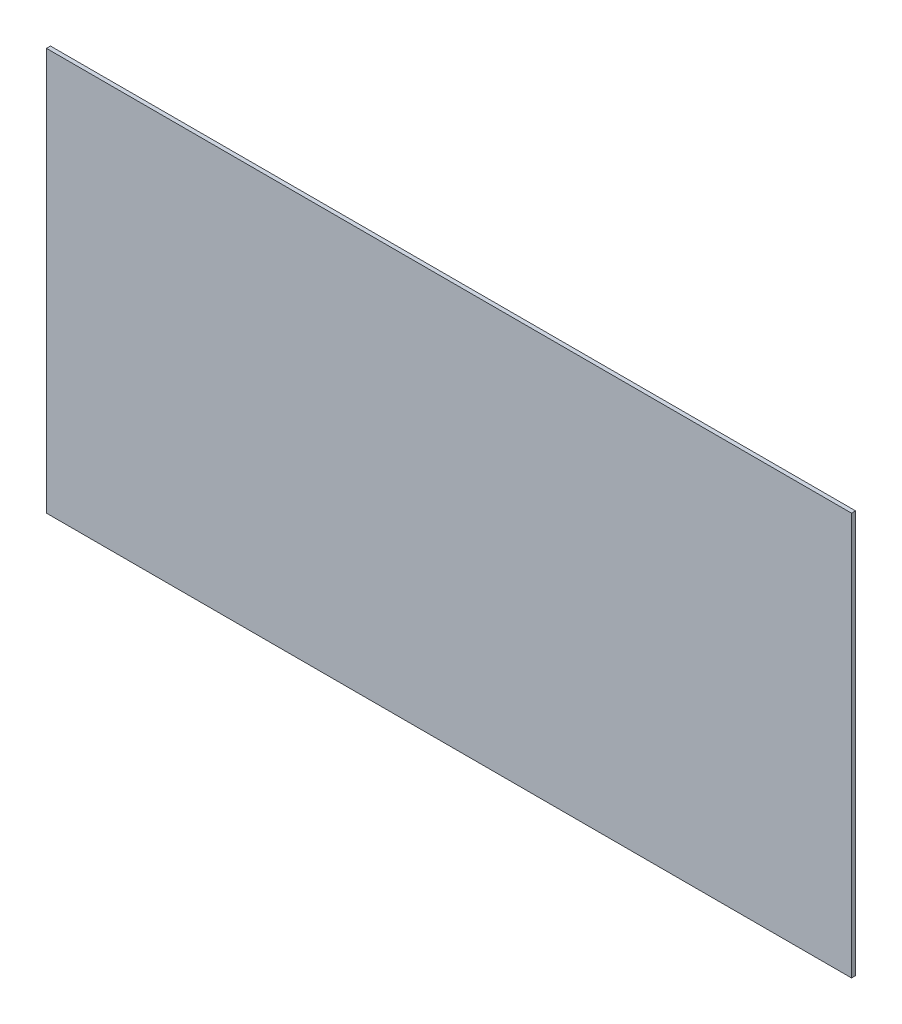
ISO-10303-21;
HEADER;
FILE_DESCRIPTION(('STEP AP214'),'2;1');
FILE_NAME('part.step','',(''),(''),'','','');
FILE_SCHEMA(('AUTOMOTIVE_DESIGN { 1 0 10303 214 1 1 1 1 }'));
ENDSEC;
DATA;
#1=APPLICATION_CONTEXT('core data for automotive mechanical design processes');
#2=APPLICATION_PROTOCOL_DEFINITION('international standard','automotive_design',2000,#1);
#3=PRODUCT_CONTEXT('',#1,'mechanical');
#4=PRODUCT('Part','Part','',(#3));
#5=PRODUCT_RELATED_PRODUCT_CATEGORY('part','',(#4));
#6=PRODUCT_DEFINITION_FORMATION('','',#4);
#7=PRODUCT_DEFINITION_CONTEXT('part definition',#1,'design');
#8=PRODUCT_DEFINITION('design','',#6,#7);
#9=PRODUCT_DEFINITION_SHAPE('','',#8);
#10=(LENGTH_UNIT() NAMED_UNIT(*) SI_UNIT(.MILLI.,.METRE.));
#11=(NAMED_UNIT(*) PLANE_ANGLE_UNIT() SI_UNIT($,.RADIAN.));
#12=(NAMED_UNIT(*) SI_UNIT($,.STERADIAN.) SOLID_ANGLE_UNIT());
#13=UNCERTAINTY_MEASURE_WITH_UNIT(LENGTH_MEASURE(1.E-05),#10,'distance_accuracy_value','');
#14=(GEOMETRIC_REPRESENTATION_CONTEXT(3) GLOBAL_UNCERTAINTY_ASSIGNED_CONTEXT((#13)) GLOBAL_UNIT_ASSIGNED_CONTEXT((#10,
#11,#12)) REPRESENTATION_CONTEXT('',''));
#15=CARTESIAN_POINT('',(0.,0.,0.));
#16=DIRECTION('',(0.,0.,1.));
#17=DIRECTION('',(1.,0.,0.));
#18=AXIS2_PLACEMENT_3D('',#15,#16,#17);
#19=CARTESIAN_POINT('',(0.,0.,3.));
#20=DIRECTION('',(1.,0.,0.));
#21=DIRECTION('',(0.,0.,-1.));
#22=AXIS2_PLACEMENT_3D('',#19,#20,#21);
#23=PLANE('',#22);
#24=DIRECTION('',(0.,-1.,0.));
#25=VECTOR('',#24,1.);
#26=CARTESIAN_POINT('',(0.,0.,0.));
#27=LINE('',#26,#25);
#28=CARTESIAN_POINT('',(0.,300.,0.));
#29=VERTEX_POINT('',#28);
#30=CARTESIAN_POINT('',(0.,0.,0.));
#31=VERTEX_POINT('',#30);
#32=EDGE_CURVE('E95',#29,#31,#27,.T.);
#33=ORIENTED_EDGE('',*,*,#32,.T.);
#34=DIRECTION('',(0.,0.,-1.));
#35=VECTOR('',#34,1.);
#36=CARTESIAN_POINT('',(0.,0.,3.));
#37=LINE('',#36,#35);
#38=CARTESIAN_POINT('',(0.,0.,3.));
#39=VERTEX_POINT('',#38);
#40=EDGE_CURVE('E11',#39,#31,#37,.T.);
#41=ORIENTED_EDGE('',*,*,#40,.F.);
#42=DIRECTION('',(0.,-1.,0.));
#43=VECTOR('',#42,1.);
#44=CARTESIAN_POINT('',(0.,0.,3.));
#45=LINE('',#44,#43);
#46=CARTESIAN_POINT('',(0.,300.,3.));
#47=VERTEX_POINT('',#46);
#48=EDGE_CURVE('E83',#47,#39,#45,.T.);
#49=ORIENTED_EDGE('',*,*,#48,.F.);
#50=DIRECTION('',(0.,0.,-1.));
#51=VECTOR('',#50,1.);
#52=CARTESIAN_POINT('',(0.,300.,3.));
#53=LINE('',#52,#51);
#54=EDGE_CURVE('E91',#47,#29,#53,.T.);
#55=ORIENTED_EDGE('',*,*,#54,.T.);
#56=EDGE_LOOP('',(#33,#41,#49,#55));
#57=FACE_BOUND('',#56,.T.);
#58=ADVANCED_FACE('F32',(#57),#23,.F.);
#59=CARTESIAN_POINT('',(0.,0.,3.));
#60=DIRECTION('',(0.,1.,0.));
#61=DIRECTION('',(0.,0.,1.));
#62=AXIS2_PLACEMENT_3D('',#59,#60,#61);
#63=PLANE('',#62);
#64=DIRECTION('',(1.,0.,0.));
#65=VECTOR('',#64,1.);
#66=CARTESIAN_POINT('',(0.,0.,0.));
#67=LINE('',#66,#65);
#68=CARTESIAN_POINT('',(600.,0.,0.));
#69=VERTEX_POINT('',#68);
#70=EDGE_CURVE('E87',#31,#69,#67,.T.);
#71=ORIENTED_EDGE('',*,*,#70,.T.);
#72=DIRECTION('',(0.,0.,-1.));
#73=VECTOR('',#72,1.);
#74=CARTESIAN_POINT('',(600.,0.,3.));
#75=LINE('',#74,#73);
#76=CARTESIAN_POINT('',(600.,0.,3.));
#77=VERTEX_POINT('',#76);
#78=EDGE_CURVE('E40',#77,#69,#75,.T.);
#79=ORIENTED_EDGE('',*,*,#78,.F.);
#80=DIRECTION('',(1.,0.,0.));
#81=VECTOR('',#80,1.);
#82=CARTESIAN_POINT('',(0.,0.,3.));
#83=LINE('',#82,#81);
#84=EDGE_CURVE('E78',#39,#77,#83,.T.);
#85=ORIENTED_EDGE('',*,*,#84,.F.);
#86=ORIENTED_EDGE('',*,*,#40,.T.);
#87=EDGE_LOOP('',(#71,#79,#85,#86));
#88=FACE_BOUND('',#87,.T.);
#89=ADVANCED_FACE('F86',(#88),#63,.F.);
#90=CARTESIAN_POINT('',(600.,0.,3.));
#91=DIRECTION('',(-1.,0.,0.));
#92=DIRECTION('',(0.,0.,1.));
#93=AXIS2_PLACEMENT_3D('',#90,#91,#92);
#94=PLANE('',#93);
#95=DIRECTION('',(0.,1.,0.));
#96=VECTOR('',#95,1.);
#97=CARTESIAN_POINT('',(600.,0.,0.));
#98=LINE('',#97,#96);
#99=CARTESIAN_POINT('',(600.,300.,0.));
#100=VERTEX_POINT('',#99);
#101=EDGE_CURVE('E65',#69,#100,#98,.T.);
#102=ORIENTED_EDGE('',*,*,#101,.T.);
#103=DIRECTION('',(0.,0.,-1.));
#104=VECTOR('',#103,1.);
#105=CARTESIAN_POINT('',(600.,300.,3.));
#106=LINE('',#105,#104);
#107=CARTESIAN_POINT('',(600.,300.,3.));
#108=VERTEX_POINT('',#107);
#109=EDGE_CURVE('E88',#108,#100,#106,.T.);
#110=ORIENTED_EDGE('',*,*,#109,.F.);
#111=DIRECTION('',(0.,1.,0.));
#112=VECTOR('',#111,1.);
#113=CARTESIAN_POINT('',(600.,0.,3.));
#114=LINE('',#113,#112);
#115=EDGE_CURVE('E81',#77,#108,#114,.T.);
#116=ORIENTED_EDGE('',*,*,#115,.F.);
#117=ORIENTED_EDGE('',*,*,#78,.T.);
#118=EDGE_LOOP('',(#102,#110,#116,#117));
#119=FACE_BOUND('',#118,.T.);
#120=ADVANCED_FACE('F89',(#119),#94,.F.);
#121=CARTESIAN_POINT('',(0.,300.,3.));
#122=DIRECTION('',(0.,-1.,0.));
#123=DIRECTION('',(0.,0.,-1.));
#124=AXIS2_PLACEMENT_3D('',#121,#122,#123);
#125=PLANE('',#124);
#126=DIRECTION('',(-1.,0.,0.));
#127=VECTOR('',#126,1.);
#128=CARTESIAN_POINT('',(0.,300.,0.));
#129=LINE('',#128,#127);
#130=EDGE_CURVE('E71',#100,#29,#129,.T.);
#131=ORIENTED_EDGE('',*,*,#130,.T.);
#132=ORIENTED_EDGE('',*,*,#54,.F.);
#133=DIRECTION('',(-1.,0.,0.));
#134=VECTOR('',#133,1.);
#135=CARTESIAN_POINT('',(0.,300.,3.));
#136=LINE('',#135,#134);
#137=EDGE_CURVE('E48',#108,#47,#136,.T.);
#138=ORIENTED_EDGE('',*,*,#137,.F.);
#139=ORIENTED_EDGE('',*,*,#109,.T.);
#140=EDGE_LOOP('',(#131,#132,#138,#139));
#141=FACE_BOUND('',#140,.T.);
#142=ADVANCED_FACE('F102',(#141),#125,.F.);
#143=CARTESIAN_POINT('',(0.,0.,3.));
#144=DIRECTION('',(0.,0.,-1.));
#145=DIRECTION('',(-1.,0.,0.));
#146=AXIS2_PLACEMENT_3D('',#143,#144,#145);
#147=PLANE('',#146);
#148=ORIENTED_EDGE('',*,*,#48,.T.);
#149=ORIENTED_EDGE('',*,*,#84,.T.);
#150=ORIENTED_EDGE('',*,*,#115,.T.);
#151=ORIENTED_EDGE('',*,*,#137,.T.);
#152=EDGE_LOOP('',(#148,#149,#150,#151));
#153=FACE_BOUND('',#152,.T.);
#154=ADVANCED_FACE('F79',(#153),#147,.F.);
#155=CARTESIAN_POINT('',(0.,0.,0.));
#156=DIRECTION('',(0.,0.,-1.));
#157=DIRECTION('',(-1.,0.,0.));
#158=AXIS2_PLACEMENT_3D('',#155,#156,#157);
#159=PLANE('',#158);
#160=ORIENTED_EDGE('',*,*,#32,.F.);
#161=ORIENTED_EDGE('',*,*,#130,.F.);
#162=ORIENTED_EDGE('',*,*,#101,.F.);
#163=ORIENTED_EDGE('',*,*,#70,.F.);
#164=EDGE_LOOP('',(#160,#161,#162,#163));
#165=FACE_BOUND('',#164,.T.);
#166=ADVANCED_FACE('F105',(#165),#159,.T.);
#167=CLOSED_SHELL('',(#58,#89,#120,#142,#154,#166));
#168=MANIFOLD_SOLID_BREP('B2',#167);
#169=ADVANCED_BREP_SHAPE_REPRESENTATION('',(#18,#168),#14);
#170=SHAPE_DEFINITION_REPRESENTATION(#9,#169);
ENDSEC;
END-ISO-10303-21;
